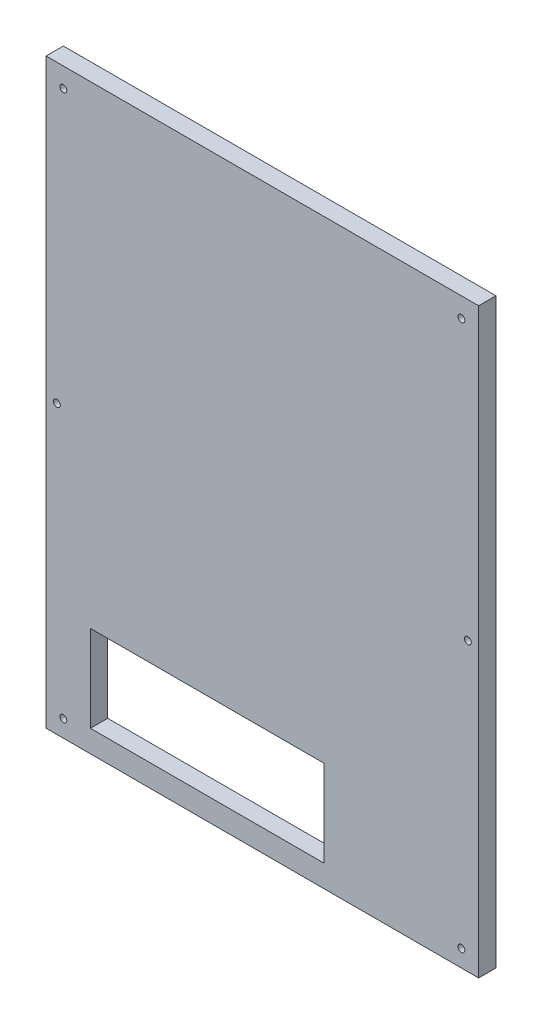
ISO-10303-21;
HEADER;
FILE_DESCRIPTION(('STEP AP214'),'2;1');
FILE_NAME('part.step','',(''),(''),'','','');
FILE_SCHEMA(('AUTOMOTIVE_DESIGN { 1 0 10303 214 1 1 1 1 }'));
ENDSEC;
DATA;
#1=APPLICATION_CONTEXT('core data for automotive mechanical design processes');
#2=APPLICATION_PROTOCOL_DEFINITION('international standard','automotive_design',2000,#1);
#3=PRODUCT_CONTEXT('',#1,'mechanical');
#4=PRODUCT('Part','Part','',(#3));
#5=PRODUCT_RELATED_PRODUCT_CATEGORY('part','',(#4));
#6=PRODUCT_DEFINITION_FORMATION('','',#4);
#7=PRODUCT_DEFINITION_CONTEXT('part definition',#1,'design');
#8=PRODUCT_DEFINITION('design','',#6,#7);
#9=PRODUCT_DEFINITION_SHAPE('','',#8);
#10=(LENGTH_UNIT() NAMED_UNIT(*) SI_UNIT(.MILLI.,.METRE.));
#11=(NAMED_UNIT(*) PLANE_ANGLE_UNIT() SI_UNIT($,.RADIAN.));
#12=(NAMED_UNIT(*) SI_UNIT($,.STERADIAN.) SOLID_ANGLE_UNIT());
#13=UNCERTAINTY_MEASURE_WITH_UNIT(LENGTH_MEASURE(1.E-05),#10,'distance_accuracy_value','');
#14=(GEOMETRIC_REPRESENTATION_CONTEXT(3) GLOBAL_UNCERTAINTY_ASSIGNED_CONTEXT((#13)) GLOBAL_UNIT_ASSIGNED_CONTEXT((#10,
#11,#12)) REPRESENTATION_CONTEXT('',''));
#15=CARTESIAN_POINT('',(0.,0.,0.));
#16=DIRECTION('',(0.,0.,1.));
#17=DIRECTION('',(1.,0.,0.));
#18=AXIS2_PLACEMENT_3D('',#15,#16,#17);
#19=CARTESIAN_POINT('',(125.,168.21,10.));
#20=DIRECTION('',(-1.,0.,0.));
#21=DIRECTION('',(0.,-1.,0.));
#22=AXIS2_PLACEMENT_3D('',#19,#20,#21);
#23=PLANE('',#22);
#24=DIRECTION('',(0.,1.,0.));
#25=VECTOR('',#24,1.);
#26=CARTESIAN_POINT('',(125.,168.21,0.));
#27=LINE('',#26,#25);
#28=CARTESIAN_POINT('',(125.,-168.21,0.));
#29=VERTEX_POINT('',#28);
#30=CARTESIAN_POINT('',(125.,168.21,0.));
#31=VERTEX_POINT('',#30);
#32=EDGE_CURVE('E165',#29,#31,#27,.T.);
#33=ORIENTED_EDGE('',*,*,#32,.T.);
#34=DIRECTION('',(0.,0.,-1.));
#35=VECTOR('',#34,1.);
#36=CARTESIAN_POINT('',(125.,168.21,10.));
#37=LINE('',#36,#35);
#38=CARTESIAN_POINT('',(125.,168.21,10.));
#39=VERTEX_POINT('',#38);
#40=EDGE_CURVE('E11',#39,#31,#37,.T.);
#41=ORIENTED_EDGE('',*,*,#40,.F.);
#42=DIRECTION('',(0.,1.,0.));
#43=VECTOR('',#42,1.);
#44=CARTESIAN_POINT('',(125.,168.21,10.));
#45=LINE('',#44,#43);
#46=CARTESIAN_POINT('',(125.,-168.21,10.));
#47=VERTEX_POINT('',#46);
#48=EDGE_CURVE('E168',#47,#39,#45,.T.);
#49=ORIENTED_EDGE('',*,*,#48,.F.);
#50=DIRECTION('',(0.,0.,-1.));
#51=VECTOR('',#50,1.);
#52=CARTESIAN_POINT('',(125.,-168.21,10.));
#53=LINE('',#52,#51);
#54=EDGE_CURVE('E178',#47,#29,#53,.T.);
#55=ORIENTED_EDGE('',*,*,#54,.T.);
#56=EDGE_LOOP('',(#33,#41,#49,#55));
#57=FACE_BOUND('',#56,.T.);
#58=ADVANCED_FACE('F33',(#57),#23,.F.);
#59=CARTESIAN_POINT('',(-125.,168.21,10.));
#60=DIRECTION('',(0.,-1.,0.));
#61=DIRECTION('',(0.,0.,-1.));
#62=AXIS2_PLACEMENT_3D('',#59,#60,#61);
#63=PLANE('',#62);
#64=DIRECTION('',(-1.,0.,0.));
#65=VECTOR('',#64,1.);
#66=CARTESIAN_POINT('',(-125.,168.21,0.));
#67=LINE('',#66,#65);
#68=CARTESIAN_POINT('',(-125.,168.21,0.));
#69=VERTEX_POINT('',#68);
#70=EDGE_CURVE('E181',#31,#69,#67,.T.);
#71=ORIENTED_EDGE('',*,*,#70,.T.);
#72=DIRECTION('',(0.,0.,-1.));
#73=VECTOR('',#72,1.);
#74=CARTESIAN_POINT('',(-125.,168.21,10.));
#75=LINE('',#74,#73);
#76=CARTESIAN_POINT('',(-125.,168.21,10.));
#77=VERTEX_POINT('',#76);
#78=EDGE_CURVE('E40',#77,#69,#75,.T.);
#79=ORIENTED_EDGE('',*,*,#78,.F.);
#80=DIRECTION('',(-1.,0.,0.));
#81=VECTOR('',#80,1.);
#82=CARTESIAN_POINT('',(-125.,168.21,10.));
#83=LINE('',#82,#81);
#84=EDGE_CURVE('E171',#39,#77,#83,.T.);
#85=ORIENTED_EDGE('',*,*,#84,.F.);
#86=ORIENTED_EDGE('',*,*,#40,.T.);
#87=EDGE_LOOP('',(#71,#79,#85,#86));
#88=FACE_BOUND('',#87,.T.);
#89=ADVANCED_FACE('F210',(#88),#63,.F.);
#90=CARTESIAN_POINT('',(-125.,168.21,10.));
#91=DIRECTION('',(1.,0.,0.));
#92=DIRECTION('',(0.,1.,0.));
#93=AXIS2_PLACEMENT_3D('',#90,#91,#92);
#94=PLANE('',#93);
#95=DIRECTION('',(0.,-1.,0.));
#96=VECTOR('',#95,1.);
#97=CARTESIAN_POINT('',(-125.,168.21,0.));
#98=LINE('',#97,#96);
#99=CARTESIAN_POINT('',(-125.,-168.21,0.));
#100=VERTEX_POINT('',#99);
#101=EDGE_CURVE('E183',#69,#100,#98,.T.);
#102=ORIENTED_EDGE('',*,*,#101,.T.);
#103=DIRECTION('',(0.,0.,-1.));
#104=VECTOR('',#103,1.);
#105=CARTESIAN_POINT('',(-125.,-168.21,10.));
#106=LINE('',#105,#104);
#107=CARTESIAN_POINT('',(-125.,-168.21,10.));
#108=VERTEX_POINT('',#107);
#109=EDGE_CURVE('E188',#108,#100,#106,.T.);
#110=ORIENTED_EDGE('',*,*,#109,.F.);
#111=DIRECTION('',(0.,-1.,0.));
#112=VECTOR('',#111,1.);
#113=CARTESIAN_POINT('',(-125.,168.21,10.));
#114=LINE('',#113,#112);
#115=EDGE_CURVE('E174',#77,#108,#114,.T.);
#116=ORIENTED_EDGE('',*,*,#115,.F.);
#117=ORIENTED_EDGE('',*,*,#78,.T.);
#118=EDGE_LOOP('',(#102,#110,#116,#117));
#119=FACE_BOUND('',#118,.T.);
#120=ADVANCED_FACE('F195',(#119),#94,.F.);
#121=CARTESIAN_POINT('',(-125.,-168.21,10.));
#122=DIRECTION('',(0.,1.,0.));
#123=DIRECTION('',(0.,0.,1.));
#124=AXIS2_PLACEMENT_3D('',#121,#122,#123);
#125=PLANE('',#124);
#126=DIRECTION('',(1.,0.,0.));
#127=VECTOR('',#126,1.);
#128=CARTESIAN_POINT('',(-125.,-168.21,0.));
#129=LINE('',#128,#127);
#130=EDGE_CURVE('E172',#100,#29,#129,.T.);
#131=ORIENTED_EDGE('',*,*,#130,.T.);
#132=ORIENTED_EDGE('',*,*,#54,.F.);
#133=DIRECTION('',(1.,0.,0.));
#134=VECTOR('',#133,1.);
#135=CARTESIAN_POINT('',(-125.,-168.21,10.));
#136=LINE('',#135,#134);
#137=EDGE_CURVE('E176',#108,#47,#136,.T.);
#138=ORIENTED_EDGE('',*,*,#137,.F.);
#139=ORIENTED_EDGE('',*,*,#109,.T.);
#140=EDGE_LOOP('',(#131,#132,#138,#139));
#141=FACE_BOUND('',#140,.T.);
#142=ADVANCED_FACE('F204',(#141),#125,.F.);
#143=CARTESIAN_POINT('',(0.,0.,10.));
#144=DIRECTION('',(0.,0.,1.));
#145=DIRECTION('',(1.,0.,0.));
#146=AXIS2_PLACEMENT_3D('',#143,#144,#145);
#147=PLANE('',#146);
#148=DIRECTION('',(0.,-1.,0.));
#149=VECTOR('',#148,1.);
#150=CARTESIAN_POINT('',(35.6393328779925,-105.421960956902,10.));
#151=LINE('',#150,#149);
#152=CARTESIAN_POINT('',(35.6393328779925,-105.421960956902,10.));
#153=VERTEX_POINT('',#152);
#154=CARTESIAN_POINT('',(35.6393328779925,-155.421960956902,10.));
#155=VERTEX_POINT('',#154);
#156=EDGE_CURVE('E107',#153,#155,#151,.T.);
#157=ORIENTED_EDGE('',*,*,#156,.T.);
#158=DIRECTION('',(-1.,0.,0.));
#159=VECTOR('',#158,1.);
#160=CARTESIAN_POINT('',(35.6393328779925,-155.421960956902,10.));
#161=LINE('',#160,#159);
#162=CARTESIAN_POINT('',(-99.3606671220075,-155.421960956902,10.));
#163=VERTEX_POINT('',#162);
#164=EDGE_CURVE('E96',#155,#163,#161,.T.);
#165=ORIENTED_EDGE('',*,*,#164,.T.);
#166=DIRECTION('',(0.,1.,0.));
#167=VECTOR('',#166,1.);
#168=CARTESIAN_POINT('',(-99.3606671220075,-105.421960956902,10.));
#169=LINE('',#168,#167);
#170=CARTESIAN_POINT('',(-99.3606671220075,-105.421960956902,10.));
#171=VERTEX_POINT('',#170);
#172=EDGE_CURVE('E118',#163,#171,#169,.T.);
#173=ORIENTED_EDGE('',*,*,#172,.T.);
#174=DIRECTION('',(1.,0.,0.));
#175=VECTOR('',#174,1.);
#176=CARTESIAN_POINT('',(35.6393328779925,-105.421960956902,10.));
#177=LINE('',#176,#175);
#178=EDGE_CURVE('E114',#171,#153,#177,.T.);
#179=ORIENTED_EDGE('',*,*,#178,.T.);
#180=EDGE_LOOP('',(#157,#165,#173,#179));
#181=FACE_BOUND('',#180,.T.);
#182=CARTESIAN_POINT('',(115.000000000001,-158.388099130706,10.));
#183=DIRECTION('',(0.,0.,1.));
#184=DIRECTION('',(1.,0.,0.));
#185=AXIS2_PLACEMENT_3D('',#182,#183,#184);
#186=CIRCLE('',#185,2.);
#187=CARTESIAN_POINT('',(117.000000000001,-158.388099130706,10.));
#188=VERTEX_POINT('',#187);
#189=EDGE_CURVE('E135',#188,#188,#186,.F.);
#190=ORIENTED_EDGE('',*,*,#189,.T.);
#191=EDGE_LOOP('',(#190));
#192=FACE_BOUND('',#191,.T.);
#193=CARTESIAN_POINT('',(-118.75,-2.47272419473549,10.));
#194=DIRECTION('',(0.,0.,1.));
#195=DIRECTION('',(1.,0.,0.));
#196=AXIS2_PLACEMENT_3D('',#193,#194,#195);
#197=CIRCLE('',#196,1.99999999999887);
#198=CARTESIAN_POINT('',(-116.750000000001,-2.47272419473549,10.));
#199=VERTEX_POINT('',#198);
#200=EDGE_CURVE('E142',#199,#199,#197,.F.);
#201=ORIENTED_EDGE('',*,*,#200,.T.);
#202=EDGE_LOOP('',(#201));
#203=FACE_BOUND('',#202,.T.);
#204=CARTESIAN_POINT('',(118.749999999998,-2.47272419473985,10.));
#205=DIRECTION('',(0.,0.,1.));
#206=DIRECTION('',(1.,0.,0.));
#207=AXIS2_PLACEMENT_3D('',#204,#205,#206);
#208=CIRCLE('',#207,2.);
#209=CARTESIAN_POINT('',(120.749999999998,-2.47272419473985,10.));
#210=VERTEX_POINT('',#209);
#211=EDGE_CURVE('E141',#210,#210,#208,.F.);
#212=ORIENTED_EDGE('',*,*,#211,.T.);
#213=EDGE_LOOP('',(#212));
#214=FACE_BOUND('',#213,.T.);
#215=CARTESIAN_POINT('',(114.999999999999,156.881750805438,10.));
#216=DIRECTION('',(0.,0.,1.));
#217=DIRECTION('',(1.,0.,0.));
#218=AXIS2_PLACEMENT_3D('',#215,#216,#217);
#219=CIRCLE('',#218,2.);
#220=CARTESIAN_POINT('',(116.999999999999,156.881750805438,10.));
#221=VERTEX_POINT('',#220);
#222=EDGE_CURVE('E154',#221,#221,#219,.F.);
#223=ORIENTED_EDGE('',*,*,#222,.T.);
#224=EDGE_LOOP('',(#223));
#225=FACE_BOUND('',#224,.T.);
#226=CARTESIAN_POINT('',(-114.999999999999,-158.388099130708,10.));
#227=DIRECTION('',(0.,0.,1.));
#228=DIRECTION('',(1.,0.,0.));
#229=AXIS2_PLACEMENT_3D('',#226,#227,#228);
#230=CIRCLE('',#229,2.);
#231=CARTESIAN_POINT('',(-112.999999999999,-158.388099130708,10.));
#232=VERTEX_POINT('',#231);
#233=EDGE_CURVE('E103',#232,#232,#230,.F.);
#234=ORIENTED_EDGE('',*,*,#233,.T.);
#235=EDGE_LOOP('',(#234));
#236=FACE_BOUND('',#235,.T.);
#237=CARTESIAN_POINT('',(-115.000000000001,156.881750805436,10.));
#238=DIRECTION('',(0.,0.,1.));
#239=DIRECTION('',(1.,0.,0.));
#240=AXIS2_PLACEMENT_3D('',#237,#238,#239);
#241=CIRCLE('',#240,2.);
#242=CARTESIAN_POINT('',(-113.000000000001,156.881750805436,10.));
#243=VERTEX_POINT('',#242);
#244=EDGE_CURVE('E153',#243,#243,#241,.F.);
#245=ORIENTED_EDGE('',*,*,#244,.T.);
#246=EDGE_LOOP('',(#245));
#247=FACE_BOUND('',#246,.T.);
#248=ORIENTED_EDGE('',*,*,#48,.T.);
#249=ORIENTED_EDGE('',*,*,#84,.T.);
#250=ORIENTED_EDGE('',*,*,#115,.T.);
#251=ORIENTED_EDGE('',*,*,#137,.T.);
#252=EDGE_LOOP('',(#248,#249,#250,#251));
#253=FACE_BOUND('',#252,.T.);
#254=ADVANCED_FACE('F112',(#181,#192,#203,#214,#225,#236,#247,#253),#147,.T.);
#255=CARTESIAN_POINT('',(0.,0.,0.));
#256=DIRECTION('',(0.,0.,1.));
#257=DIRECTION('',(1.,0.,0.));
#258=AXIS2_PLACEMENT_3D('',#255,#256,#257);
#259=PLANE('',#258);
#260=DIRECTION('',(-1.,0.,0.));
#261=VECTOR('',#260,1.);
#262=CARTESIAN_POINT('',(35.6393328779925,-155.421960956902,0.));
#263=LINE('',#262,#261);
#264=CARTESIAN_POINT('',(35.6393328779925,-155.421960956902,0.));
#265=VERTEX_POINT('',#264);
#266=CARTESIAN_POINT('',(-99.3606671220075,-155.421960956902,0.));
#267=VERTEX_POINT('',#266);
#268=EDGE_CURVE('E116',#265,#267,#263,.T.);
#269=ORIENTED_EDGE('',*,*,#268,.F.);
#270=DIRECTION('',(0.,-1.,0.));
#271=VECTOR('',#270,1.);
#272=CARTESIAN_POINT('',(35.6393328779925,-105.421960956902,0.));
#273=LINE('',#272,#271);
#274=CARTESIAN_POINT('',(35.6393328779925,-105.421960956902,0.));
#275=VERTEX_POINT('',#274);
#276=EDGE_CURVE('E55',#275,#265,#273,.T.);
#277=ORIENTED_EDGE('',*,*,#276,.F.);
#278=DIRECTION('',(1.,0.,0.));
#279=VECTOR('',#278,1.);
#280=CARTESIAN_POINT('',(35.6393328779925,-105.421960956902,0.));
#281=LINE('',#280,#279);
#282=CARTESIAN_POINT('',(-99.3606671220075,-105.421960956902,0.));
#283=VERTEX_POINT('',#282);
#284=EDGE_CURVE('E109',#283,#275,#281,.T.);
#285=ORIENTED_EDGE('',*,*,#284,.F.);
#286=DIRECTION('',(0.,1.,0.));
#287=VECTOR('',#286,1.);
#288=CARTESIAN_POINT('',(-99.3606671220075,-105.421960956902,0.));
#289=LINE('',#288,#287);
#290=EDGE_CURVE('E123',#267,#283,#289,.T.);
#291=ORIENTED_EDGE('',*,*,#290,.F.);
#292=EDGE_LOOP('',(#269,#277,#285,#291));
#293=FACE_BOUND('',#292,.T.);
#294=CARTESIAN_POINT('',(115.000000000001,-158.388099130706,0.));
#295=DIRECTION('',(0.,0.,-1.));
#296=DIRECTION('',(-1.,0.,0.));
#297=AXIS2_PLACEMENT_3D('',#294,#295,#296);
#298=CIRCLE('',#297,2.);
#299=CARTESIAN_POINT('',(113.000000000001,-158.388099130706,0.));
#300=VERTEX_POINT('',#299);
#301=EDGE_CURVE('E145',#300,#300,#298,.T.);
#302=ORIENTED_EDGE('',*,*,#301,.F.);
#303=EDGE_LOOP('',(#302));
#304=FACE_BOUND('',#303,.T.);
#305=CARTESIAN_POINT('',(-118.75,-2.47272419473549,0.));
#306=DIRECTION('',(0.,0.,-1.));
#307=DIRECTION('',(-1.,0.,0.));
#308=AXIS2_PLACEMENT_3D('',#305,#306,#307);
#309=CIRCLE('',#308,1.99999999999887);
#310=CARTESIAN_POINT('',(-120.749999999999,-2.47272419473549,0.));
#311=VERTEX_POINT('',#310);
#312=EDGE_CURVE('E138',#311,#311,#309,.T.);
#313=ORIENTED_EDGE('',*,*,#312,.F.);
#314=EDGE_LOOP('',(#313));
#315=FACE_BOUND('',#314,.T.);
#316=CARTESIAN_POINT('',(118.749999999998,-2.47272419473985,0.));
#317=DIRECTION('',(0.,0.,-1.));
#318=DIRECTION('',(-1.,0.,0.));
#319=AXIS2_PLACEMENT_3D('',#316,#317,#318);
#320=CIRCLE('',#319,2.);
#321=CARTESIAN_POINT('',(116.749999999998,-2.47272419473985,0.));
#322=VERTEX_POINT('',#321);
#323=EDGE_CURVE('E157',#322,#322,#320,.T.);
#324=ORIENTED_EDGE('',*,*,#323,.F.);
#325=EDGE_LOOP('',(#324));
#326=FACE_BOUND('',#325,.T.);
#327=CARTESIAN_POINT('',(114.999999999999,156.881750805438,0.));
#328=DIRECTION('',(0.,0.,-1.));
#329=DIRECTION('',(-1.,0.,0.));
#330=AXIS2_PLACEMENT_3D('',#327,#328,#329);
#331=CIRCLE('',#330,2.);
#332=CARTESIAN_POINT('',(112.999999999999,156.881750805438,0.));
#333=VERTEX_POINT('',#332);
#334=EDGE_CURVE('E150',#333,#333,#331,.T.);
#335=ORIENTED_EDGE('',*,*,#334,.F.);
#336=EDGE_LOOP('',(#335));
#337=FACE_BOUND('',#336,.T.);
#338=CARTESIAN_POINT('',(-114.999999999999,-158.388099130708,0.));
#339=DIRECTION('',(0.,0.,-1.));
#340=DIRECTION('',(-1.,0.,0.));
#341=AXIS2_PLACEMENT_3D('',#338,#339,#340);
#342=CIRCLE('',#341,2.);
#343=CARTESIAN_POINT('',(-116.999999999999,-158.388099130708,0.));
#344=VERTEX_POINT('',#343);
#345=EDGE_CURVE('E132',#344,#344,#342,.T.);
#346=ORIENTED_EDGE('',*,*,#345,.F.);
#347=EDGE_LOOP('',(#346));
#348=FACE_BOUND('',#347,.T.);
#349=CARTESIAN_POINT('',(-115.000000000001,156.881750805436,0.));
#350=DIRECTION('',(0.,0.,-1.));
#351=DIRECTION('',(-1.,0.,0.));
#352=AXIS2_PLACEMENT_3D('',#349,#350,#351);
#353=CIRCLE('',#352,2.);
#354=CARTESIAN_POINT('',(-117.000000000001,156.881750805436,0.));
#355=VERTEX_POINT('',#354);
#356=EDGE_CURVE('E162',#355,#355,#353,.T.);
#357=ORIENTED_EDGE('',*,*,#356,.F.);
#358=EDGE_LOOP('',(#357));
#359=FACE_BOUND('',#358,.T.);
#360=ORIENTED_EDGE('',*,*,#32,.F.);
#361=ORIENTED_EDGE('',*,*,#130,.F.);
#362=ORIENTED_EDGE('',*,*,#101,.F.);
#363=ORIENTED_EDGE('',*,*,#70,.F.);
#364=EDGE_LOOP('',(#360,#361,#362,#363));
#365=FACE_BOUND('',#364,.T.);
#366=ADVANCED_FACE('F201',(#293,#304,#315,#326,#337,#348,#359,#365),#259,.F.);
#367=CARTESIAN_POINT('',(-115.000000000001,156.881750805436,10.001));
#368=DIRECTION('',(0.,0.,-1.));
#369=DIRECTION('',(-1.,0.,0.));
#370=AXIS2_PLACEMENT_3D('',#367,#368,#369);
#371=CYLINDRICAL_SURFACE('',#370,2.);
#372=ORIENTED_EDGE('',*,*,#244,.F.);
#373=EDGE_LOOP('',(#372));
#374=FACE_BOUND('',#373,.T.);
#375=ORIENTED_EDGE('',*,*,#356,.T.);
#376=EDGE_LOOP('',(#375));
#377=FACE_BOUND('',#376,.T.);
#378=ADVANCED_FACE('F222',(#374,#377),#371,.F.);
#379=CARTESIAN_POINT('',(-114.999999999999,-158.388099130708,10.001));
#380=DIRECTION('',(0.,0.,-1.));
#381=DIRECTION('',(-1.,0.,0.));
#382=AXIS2_PLACEMENT_3D('',#379,#380,#381);
#383=CYLINDRICAL_SURFACE('',#382,2.);
#384=ORIENTED_EDGE('',*,*,#233,.F.);
#385=EDGE_LOOP('',(#384));
#386=FACE_BOUND('',#385,.T.);
#387=ORIENTED_EDGE('',*,*,#345,.T.);
#388=EDGE_LOOP('',(#387));
#389=FACE_BOUND('',#388,.T.);
#390=ADVANCED_FACE('F228',(#386,#389),#383,.F.);
#391=CARTESIAN_POINT('',(114.999999999999,156.881750805438,10.001));
#392=DIRECTION('',(0.,0.,-1.));
#393=DIRECTION('',(-1.,0.,0.));
#394=AXIS2_PLACEMENT_3D('',#391,#392,#393);
#395=CYLINDRICAL_SURFACE('',#394,2.);
#396=ORIENTED_EDGE('',*,*,#222,.F.);
#397=EDGE_LOOP('',(#396));
#398=FACE_BOUND('',#397,.T.);
#399=ORIENTED_EDGE('',*,*,#334,.T.);
#400=EDGE_LOOP('',(#399));
#401=FACE_BOUND('',#400,.T.);
#402=ADVANCED_FACE('F234',(#398,#401),#395,.F.);
#403=CARTESIAN_POINT('',(118.749999999998,-2.47272419473985,10.001));
#404=DIRECTION('',(0.,0.,-1.));
#405=DIRECTION('',(-1.,0.,0.));
#406=AXIS2_PLACEMENT_3D('',#403,#404,#405);
#407=CYLINDRICAL_SURFACE('',#406,2.);
#408=ORIENTED_EDGE('',*,*,#211,.F.);
#409=EDGE_LOOP('',(#408));
#410=FACE_BOUND('',#409,.T.);
#411=ORIENTED_EDGE('',*,*,#323,.T.);
#412=EDGE_LOOP('',(#411));
#413=FACE_BOUND('',#412,.T.);
#414=ADVANCED_FACE('F230',(#410,#413),#407,.F.);
#415=CARTESIAN_POINT('',(-118.75,-2.47272419473549,10.001));
#416=DIRECTION('',(0.,0.,-1.));
#417=DIRECTION('',(-1.,0.,0.));
#418=AXIS2_PLACEMENT_3D('',#415,#416,#417);
#419=CYLINDRICAL_SURFACE('',#418,1.99999999999887);
#420=ORIENTED_EDGE('',*,*,#200,.F.);
#421=EDGE_LOOP('',(#420));
#422=FACE_BOUND('',#421,.T.);
#423=ORIENTED_EDGE('',*,*,#312,.T.);
#424=EDGE_LOOP('',(#423));
#425=FACE_BOUND('',#424,.T.);
#426=ADVANCED_FACE('F233',(#422,#425),#419,.F.);
#427=CARTESIAN_POINT('',(115.000000000001,-158.388099130706,10.001));
#428=DIRECTION('',(0.,0.,-1.));
#429=DIRECTION('',(-1.,0.,0.));
#430=AXIS2_PLACEMENT_3D('',#427,#428,#429);
#431=CYLINDRICAL_SURFACE('',#430,2.);
#432=ORIENTED_EDGE('',*,*,#189,.F.);
#433=EDGE_LOOP('',(#432));
#434=FACE_BOUND('',#433,.T.);
#435=ORIENTED_EDGE('',*,*,#301,.T.);
#436=EDGE_LOOP('',(#435));
#437=FACE_BOUND('',#436,.T.);
#438=ADVANCED_FACE('F239',(#434,#437),#431,.F.);
#439=CARTESIAN_POINT('',(35.6393328779925,-105.421960956902,10.001));
#440=DIRECTION('',(1.,0.,0.));
#441=DIRECTION('',(0.,0.,-1.));
#442=AXIS2_PLACEMENT_3D('',#439,#440,#441);
#443=PLANE('',#442);
#444=DIRECTION('',(0.,0.,-1.));
#445=VECTOR('',#444,1.);
#446=CARTESIAN_POINT('',(35.6393328779925,-105.421960956902,10.001));
#447=LINE('',#446,#445);
#448=EDGE_CURVE('E104',#153,#275,#447,.T.);
#449=ORIENTED_EDGE('',*,*,#448,.T.);
#450=ORIENTED_EDGE('',*,*,#276,.T.);
#451=DIRECTION('',(0.,0.,-1.));
#452=VECTOR('',#451,1.);
#453=CARTESIAN_POINT('',(35.6393328779925,-155.421960956902,10.001));
#454=LINE('',#453,#452);
#455=EDGE_CURVE('E98',#155,#265,#454,.T.);
#456=ORIENTED_EDGE('',*,*,#455,.F.);
#457=ORIENTED_EDGE('',*,*,#156,.F.);
#458=EDGE_LOOP('',(#449,#450,#456,#457));
#459=FACE_BOUND('',#458,.T.);
#460=ADVANCED_FACE('F106',(#459),#443,.F.);
#461=CARTESIAN_POINT('',(35.6393328779925,-105.421960956902,10.001));
#462=DIRECTION('',(0.,1.,0.));
#463=DIRECTION('',(0.,0.,1.));
#464=AXIS2_PLACEMENT_3D('',#461,#462,#463);
#465=PLANE('',#464);
#466=DIRECTION('',(0.,0.,-1.));
#467=VECTOR('',#466,1.);
#468=CARTESIAN_POINT('',(-99.3606671220075,-105.421960956902,10.001));
#469=LINE('',#468,#467);
#470=EDGE_CURVE('E129',#171,#283,#469,.T.);
#471=ORIENTED_EDGE('',*,*,#470,.T.);
#472=ORIENTED_EDGE('',*,*,#284,.T.);
#473=ORIENTED_EDGE('',*,*,#448,.F.);
#474=ORIENTED_EDGE('',*,*,#178,.F.);
#475=EDGE_LOOP('',(#471,#472,#473,#474));
#476=FACE_BOUND('',#475,.T.);
#477=ADVANCED_FACE('F251',(#476),#465,.F.);
#478=CARTESIAN_POINT('',(-99.3606671220075,-105.421960956902,10.001));
#479=DIRECTION('',(-1.,0.,0.));
#480=DIRECTION('',(0.,0.,1.));
#481=AXIS2_PLACEMENT_3D('',#478,#479,#480);
#482=PLANE('',#481);
#483=DIRECTION('',(0.,0.,-1.));
#484=VECTOR('',#483,1.);
#485=CARTESIAN_POINT('',(-99.3606671220075,-155.421960956902,10.001));
#486=LINE('',#485,#484);
#487=EDGE_CURVE('E47',#163,#267,#486,.T.);
#488=ORIENTED_EDGE('',*,*,#487,.T.);
#489=ORIENTED_EDGE('',*,*,#290,.T.);
#490=ORIENTED_EDGE('',*,*,#470,.F.);
#491=ORIENTED_EDGE('',*,*,#172,.F.);
#492=EDGE_LOOP('',(#488,#489,#490,#491));
#493=FACE_BOUND('',#492,.T.);
#494=ADVANCED_FACE('F254',(#493),#482,.F.);
#495=CARTESIAN_POINT('',(35.6393328779925,-155.421960956902,10.001));
#496=DIRECTION('',(0.,-1.,0.));
#497=DIRECTION('',(0.,0.,-1.));
#498=AXIS2_PLACEMENT_3D('',#495,#496,#497);
#499=PLANE('',#498);
#500=ORIENTED_EDGE('',*,*,#455,.T.);
#501=ORIENTED_EDGE('',*,*,#268,.T.);
#502=ORIENTED_EDGE('',*,*,#487,.F.);
#503=ORIENTED_EDGE('',*,*,#164,.F.);
#504=EDGE_LOOP('',(#500,#501,#502,#503));
#505=FACE_BOUND('',#504,.T.);
#506=ADVANCED_FACE('F97',(#505),#499,.F.);
#507=CLOSED_SHELL('',(#58,#89,#120,#142,#254,#366,#378,#390,#402,#414,#426,#438,#460,#477,#494,#506));
#508=MANIFOLD_SOLID_BREP('B2',#507);
#509=ADVANCED_BREP_SHAPE_REPRESENTATION('',(#18,#508),#14);
#510=SHAPE_DEFINITION_REPRESENTATION(#9,#509);
ENDSEC;
END-ISO-10303-21;
